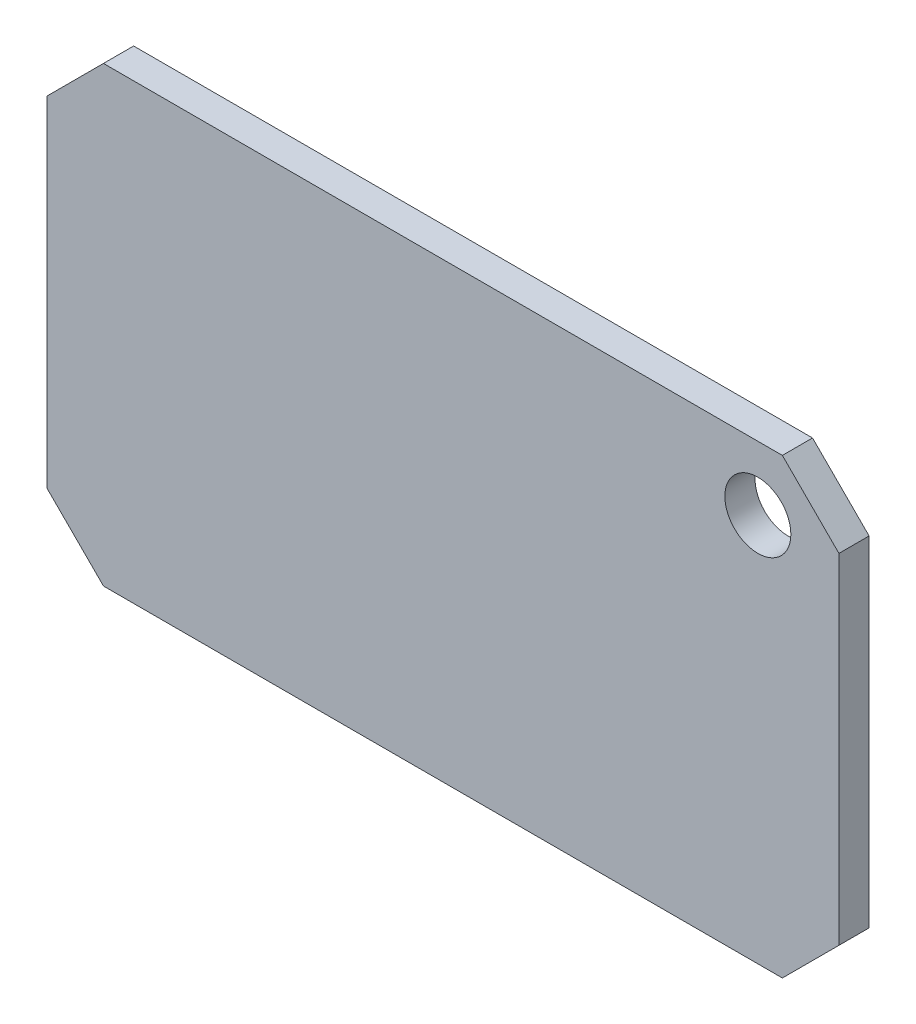
ISO-10303-21;
HEADER;
FILE_DESCRIPTION(('STEP AP214'),'2;1');
FILE_NAME('part.step','',(''),(''),'','','');
FILE_SCHEMA(('AUTOMOTIVE_DESIGN { 1 0 10303 214 1 1 1 1 }'));
ENDSEC;
DATA;
#1=APPLICATION_CONTEXT('core data for automotive mechanical design processes');
#2=APPLICATION_PROTOCOL_DEFINITION('international standard','automotive_design',2000,#1);
#3=PRODUCT_CONTEXT('',#1,'mechanical');
#4=PRODUCT('Part','Part','',(#3));
#5=PRODUCT_RELATED_PRODUCT_CATEGORY('part','',(#4));
#6=PRODUCT_DEFINITION_FORMATION('','',#4);
#7=PRODUCT_DEFINITION_CONTEXT('part definition',#1,'design');
#8=PRODUCT_DEFINITION('design','',#6,#7);
#9=PRODUCT_DEFINITION_SHAPE('','',#8);
#10=(LENGTH_UNIT() NAMED_UNIT(*) SI_UNIT(.MILLI.,.METRE.));
#11=(NAMED_UNIT(*) PLANE_ANGLE_UNIT() SI_UNIT($,.RADIAN.));
#12=(NAMED_UNIT(*) SI_UNIT($,.STERADIAN.) SOLID_ANGLE_UNIT());
#13=UNCERTAINTY_MEASURE_WITH_UNIT(LENGTH_MEASURE(1.E-05),#10,'distance_accuracy_value','');
#14=(GEOMETRIC_REPRESENTATION_CONTEXT(3) GLOBAL_UNCERTAINTY_ASSIGNED_CONTEXT((#13)) GLOBAL_UNIT_ASSIGNED_CONTEXT((#10,
#11,#12)) REPRESENTATION_CONTEXT('',''));
#15=CARTESIAN_POINT('',(0.,0.,0.));
#16=DIRECTION('',(0.,0.,1.));
#17=DIRECTION('',(1.,0.,0.));
#18=AXIS2_PLACEMENT_3D('',#15,#16,#17);
#19=CARTESIAN_POINT('',(0.,0.,1.6));
#20=DIRECTION('',(0.,0.,-1.));
#21=DIRECTION('',(-1.,0.,0.));
#22=AXIS2_PLACEMENT_3D('',#19,#20,#21);
#23=PLANE('',#22);
#24=DIRECTION('',(0.,-1.,0.));
#25=VECTOR('',#24,1.);
#26=CARTESIAN_POINT('',(-21.,-9.,1.6));
#27=LINE('',#26,#25);
#28=CARTESIAN_POINT('',(-21.,9.,1.6));
#29=VERTEX_POINT('',#28);
#30=CARTESIAN_POINT('',(-21.,-9.,1.6));
#31=VERTEX_POINT('',#30);
#32=EDGE_CURVE('E147',#29,#31,#27,.T.);
#33=ORIENTED_EDGE('',*,*,#32,.T.);
#34=DIRECTION('',(0.707106781186557,-0.707106781186538,0.));
#35=VECTOR('',#34,1.);
#36=CARTESIAN_POINT('',(-18.,-12.,1.6));
#37=LINE('',#36,#35);
#38=CARTESIAN_POINT('',(-18.,-12.,1.6));
#39=VERTEX_POINT('',#38);
#40=EDGE_CURVE('E95',#31,#39,#37,.T.);
#41=ORIENTED_EDGE('',*,*,#40,.T.);
#42=DIRECTION('',(1.,0.,0.));
#43=VECTOR('',#42,1.);
#44=CARTESIAN_POINT('',(18.,-12.,1.6));
#45=LINE('',#44,#43);
#46=CARTESIAN_POINT('',(18.,-12.,1.6));
#47=VERTEX_POINT('',#46);
#48=EDGE_CURVE('E162',#39,#47,#45,.T.);
#49=ORIENTED_EDGE('',*,*,#48,.T.);
#50=DIRECTION('',(0.707106781186552,0.707106781186543,0.));
#51=VECTOR('',#50,1.);
#52=CARTESIAN_POINT('',(21.,-9.00000000000001,1.6));
#53=LINE('',#52,#51);
#54=CARTESIAN_POINT('',(21.,-9.00000000000001,1.6));
#55=VERTEX_POINT('',#54);
#56=EDGE_CURVE('E175',#47,#55,#53,.T.);
#57=ORIENTED_EDGE('',*,*,#56,.T.);
#58=DIRECTION('',(0.,1.,0.));
#59=VECTOR('',#58,1.);
#60=CARTESIAN_POINT('',(21.,9.,1.6));
#61=LINE('',#60,#59);
#62=CARTESIAN_POINT('',(21.,9.,1.6));
#63=VERTEX_POINT('',#62);
#64=EDGE_CURVE('E114',#55,#63,#61,.T.);
#65=ORIENTED_EDGE('',*,*,#64,.T.);
#66=DIRECTION('',(-0.707106781186544,0.707106781186551,0.));
#67=VECTOR('',#66,1.);
#68=CARTESIAN_POINT('',(18.,12.,1.6));
#69=LINE('',#68,#67);
#70=CARTESIAN_POINT('',(18.,12.,1.6));
#71=VERTEX_POINT('',#70);
#72=EDGE_CURVE('E108',#63,#71,#69,.T.);
#73=ORIENTED_EDGE('',*,*,#72,.T.);
#74=DIRECTION('',(-1.,0.,0.));
#75=VECTOR('',#74,1.);
#76=CARTESIAN_POINT('',(-18.,12.,1.6));
#77=LINE('',#76,#75);
#78=CARTESIAN_POINT('',(-18.,12.,1.6));
#79=VERTEX_POINT('',#78);
#80=EDGE_CURVE('E112',#71,#79,#77,.T.);
#81=ORIENTED_EDGE('',*,*,#80,.T.);
#82=DIRECTION('',(-0.707106781186552,-0.707106781186543,0.));
#83=VECTOR('',#82,1.);
#84=CARTESIAN_POINT('',(-21.,9.,1.6));
#85=LINE('',#84,#83);
#86=EDGE_CURVE('E52',#79,#29,#85,.T.);
#87=ORIENTED_EDGE('',*,*,#86,.T.);
#88=EDGE_LOOP('',(#33,#41,#49,#57,#65,#73,#81,#87));
#89=FACE_BOUND('',#88,.T.);
#90=CARTESIAN_POINT('',(16.7,8.60000000000003,1.6));
#91=DIRECTION('',(0.,0.,1.));
#92=DIRECTION('',(1.,0.,0.));
#93=AXIS2_PLACEMENT_3D('',#90,#91,#92);
#94=CIRCLE('',#93,1.75);
#95=CARTESIAN_POINT('',(18.45,8.60000000000003,1.6));
#96=VERTEX_POINT('',#95);
#97=EDGE_CURVE('E136',#96,#96,#94,.T.);
#98=ORIENTED_EDGE('',*,*,#97,.F.);
#99=EDGE_LOOP('',(#98));
#100=FACE_BOUND('',#99,.T.);
#101=ADVANCED_FACE('F35',(#89,#100),#23,.F.);
#102=CARTESIAN_POINT('',(0.,0.,0.));
#103=DIRECTION('',(0.,0.,-1.));
#104=DIRECTION('',(-1.,0.,0.));
#105=AXIS2_PLACEMENT_3D('',#102,#103,#104);
#106=PLANE('',#105);
#107=DIRECTION('',(0.,-1.,0.));
#108=VECTOR('',#107,1.);
#109=CARTESIAN_POINT('',(-21.,-9.,0.));
#110=LINE('',#109,#108);
#111=CARTESIAN_POINT('',(-21.,9.,0.));
#112=VERTEX_POINT('',#111);
#113=CARTESIAN_POINT('',(-21.,-9.,0.));
#114=VERTEX_POINT('',#113);
#115=EDGE_CURVE('E132',#112,#114,#110,.T.);
#116=ORIENTED_EDGE('',*,*,#115,.F.);
#117=DIRECTION('',(-0.707106781186552,-0.707106781186543,0.));
#118=VECTOR('',#117,1.);
#119=CARTESIAN_POINT('',(-21.,9.,0.));
#120=LINE('',#119,#118);
#121=CARTESIAN_POINT('',(-18.,12.,0.));
#122=VERTEX_POINT('',#121);
#123=EDGE_CURVE('E87',#122,#112,#120,.T.);
#124=ORIENTED_EDGE('',*,*,#123,.F.);
#125=DIRECTION('',(-1.,0.,0.));
#126=VECTOR('',#125,1.);
#127=CARTESIAN_POINT('',(-18.,12.,0.));
#128=LINE('',#127,#126);
#129=CARTESIAN_POINT('',(18.,12.,0.));
#130=VERTEX_POINT('',#129);
#131=EDGE_CURVE('E81',#130,#122,#128,.T.);
#132=ORIENTED_EDGE('',*,*,#131,.F.);
#133=DIRECTION('',(-0.707106781186544,0.707106781186551,0.));
#134=VECTOR('',#133,1.);
#135=CARTESIAN_POINT('',(18.,12.,0.));
#136=LINE('',#135,#134);
#137=CARTESIAN_POINT('',(21.,9.,0.));
#138=VERTEX_POINT('',#137);
#139=EDGE_CURVE('E122',#138,#130,#136,.T.);
#140=ORIENTED_EDGE('',*,*,#139,.F.);
#141=DIRECTION('',(0.,1.,0.));
#142=VECTOR('',#141,1.);
#143=CARTESIAN_POINT('',(21.,9.,0.));
#144=LINE('',#143,#142);
#145=CARTESIAN_POINT('',(21.,-9.00000000000001,0.));
#146=VERTEX_POINT('',#145);
#147=EDGE_CURVE('E142',#146,#138,#144,.T.);
#148=ORIENTED_EDGE('',*,*,#147,.F.);
#149=DIRECTION('',(0.707106781186552,0.707106781186543,0.));
#150=VECTOR('',#149,1.);
#151=CARTESIAN_POINT('',(21.,-9.00000000000001,0.));
#152=LINE('',#151,#150);
#153=CARTESIAN_POINT('',(18.,-12.,0.));
#154=VERTEX_POINT('',#153);
#155=EDGE_CURVE('E140',#154,#146,#152,.T.);
#156=ORIENTED_EDGE('',*,*,#155,.F.);
#157=DIRECTION('',(1.,0.,0.));
#158=VECTOR('',#157,1.);
#159=CARTESIAN_POINT('',(18.,-12.,0.));
#160=LINE('',#159,#158);
#161=CARTESIAN_POINT('',(-18.,-12.,0.));
#162=VERTEX_POINT('',#161);
#163=EDGE_CURVE('E138',#162,#154,#160,.T.);
#164=ORIENTED_EDGE('',*,*,#163,.F.);
#165=DIRECTION('',(0.707106781186557,-0.707106781186538,0.));
#166=VECTOR('',#165,1.);
#167=CARTESIAN_POINT('',(-18.,-12.,0.));
#168=LINE('',#167,#166);
#169=EDGE_CURVE('E135',#114,#162,#168,.T.);
#170=ORIENTED_EDGE('',*,*,#169,.F.);
#171=EDGE_LOOP('',(#116,#124,#132,#140,#148,#156,#164,#170));
#172=FACE_BOUND('',#171,.T.);
#173=CARTESIAN_POINT('',(16.7,8.60000000000003,0.));
#174=DIRECTION('',(0.,0.,1.));
#175=DIRECTION('',(1.,0.,0.));
#176=AXIS2_PLACEMENT_3D('',#173,#174,#175);
#177=CIRCLE('',#176,1.75);
#178=CARTESIAN_POINT('',(18.45,8.60000000000003,0.));
#179=VERTEX_POINT('',#178);
#180=EDGE_CURVE('E181',#179,#179,#177,.T.);
#181=ORIENTED_EDGE('',*,*,#180,.T.);
#182=EDGE_LOOP('',(#181));
#183=FACE_BOUND('',#182,.T.);
#184=ADVANCED_FACE('F166',(#172,#183),#106,.T.);
#185=CARTESIAN_POINT('',(-21.,-9.,1.6));
#186=DIRECTION('',(1.,0.,0.));
#187=DIRECTION('',(0.,1.,0.));
#188=AXIS2_PLACEMENT_3D('',#185,#186,#187);
#189=PLANE('',#188);
#190=ORIENTED_EDGE('',*,*,#115,.T.);
#191=DIRECTION('',(0.,0.,-1.));
#192=VECTOR('',#191,1.);
#193=CARTESIAN_POINT('',(-21.,-9.,1.6));
#194=LINE('',#193,#192);
#195=EDGE_CURVE('E11',#31,#114,#194,.T.);
#196=ORIENTED_EDGE('',*,*,#195,.F.);
#197=ORIENTED_EDGE('',*,*,#32,.F.);
#198=DIRECTION('',(0.,0.,-1.));
#199=VECTOR('',#198,1.);
#200=CARTESIAN_POINT('',(-21.,9.,1.6));
#201=LINE('',#200,#199);
#202=EDGE_CURVE('E128',#29,#112,#201,.T.);
#203=ORIENTED_EDGE('',*,*,#202,.T.);
#204=EDGE_LOOP('',(#190,#196,#197,#203));
#205=FACE_BOUND('',#204,.T.);
#206=ADVANCED_FACE('F37',(#205),#189,.F.);
#207=CARTESIAN_POINT('',(-18.,-12.,1.6));
#208=DIRECTION('',(0.707106781186538,0.707106781186557,0.));
#209=DIRECTION('',(-0.707106781186557,0.707106781186538,0.));
#210=AXIS2_PLACEMENT_3D('',#207,#208,#209);
#211=PLANE('',#210);
#212=ORIENTED_EDGE('',*,*,#169,.T.);
#213=DIRECTION('',(0.,0.,-1.));
#214=VECTOR('',#213,1.);
#215=CARTESIAN_POINT('',(-18.,-12.,1.6));
#216=LINE('',#215,#214);
#217=EDGE_CURVE('E44',#39,#162,#216,.T.);
#218=ORIENTED_EDGE('',*,*,#217,.F.);
#219=ORIENTED_EDGE('',*,*,#40,.F.);
#220=ORIENTED_EDGE('',*,*,#195,.T.);
#221=EDGE_LOOP('',(#212,#218,#219,#220));
#222=FACE_BOUND('',#221,.T.);
#223=ADVANCED_FACE('F209',(#222),#211,.F.);
#224=CARTESIAN_POINT('',(18.,-12.,1.6));
#225=DIRECTION('',(0.,1.,0.));
#226=DIRECTION('',(0.,0.,1.));
#227=AXIS2_PLACEMENT_3D('',#224,#225,#226);
#228=PLANE('',#227);
#229=ORIENTED_EDGE('',*,*,#163,.T.);
#230=DIRECTION('',(0.,0.,-1.));
#231=VECTOR('',#230,1.);
#232=CARTESIAN_POINT('',(18.,-12.,1.6));
#233=LINE('',#232,#231);
#234=EDGE_CURVE('E154',#47,#154,#233,.T.);
#235=ORIENTED_EDGE('',*,*,#234,.F.);
#236=ORIENTED_EDGE('',*,*,#48,.F.);
#237=ORIENTED_EDGE('',*,*,#217,.T.);
#238=EDGE_LOOP('',(#229,#235,#236,#237));
#239=FACE_BOUND('',#238,.T.);
#240=ADVANCED_FACE('F160',(#239),#228,.F.);
#241=CARTESIAN_POINT('',(21.,-9.00000000000001,1.6));
#242=DIRECTION('',(-0.707106781186543,0.707106781186552,0.));
#243=DIRECTION('',(-0.707106781186552,-0.707106781186543,0.));
#244=AXIS2_PLACEMENT_3D('',#241,#242,#243);
#245=PLANE('',#244);
#246=ORIENTED_EDGE('',*,*,#155,.T.);
#247=DIRECTION('',(0.,0.,-1.));
#248=VECTOR('',#247,1.);
#249=CARTESIAN_POINT('',(21.,-9.00000000000001,1.6));
#250=LINE('',#249,#248);
#251=EDGE_CURVE('E151',#55,#146,#250,.T.);
#252=ORIENTED_EDGE('',*,*,#251,.F.);
#253=ORIENTED_EDGE('',*,*,#56,.F.);
#254=ORIENTED_EDGE('',*,*,#234,.T.);
#255=EDGE_LOOP('',(#246,#252,#253,#254));
#256=FACE_BOUND('',#255,.T.);
#257=ADVANCED_FACE('F171',(#256),#245,.F.);
#258=CARTESIAN_POINT('',(21.,9.,1.6));
#259=DIRECTION('',(-1.,0.,0.));
#260=DIRECTION('',(0.,-1.,0.));
#261=AXIS2_PLACEMENT_3D('',#258,#259,#260);
#262=PLANE('',#261);
#263=ORIENTED_EDGE('',*,*,#147,.T.);
#264=DIRECTION('',(0.,0.,-1.));
#265=VECTOR('',#264,1.);
#266=CARTESIAN_POINT('',(21.,9.,1.6));
#267=LINE('',#266,#265);
#268=EDGE_CURVE('E123',#63,#138,#267,.T.);
#269=ORIENTED_EDGE('',*,*,#268,.F.);
#270=ORIENTED_EDGE('',*,*,#64,.F.);
#271=ORIENTED_EDGE('',*,*,#251,.T.);
#272=EDGE_LOOP('',(#263,#269,#270,#271));
#273=FACE_BOUND('',#272,.T.);
#274=ADVANCED_FACE('F174',(#273),#262,.F.);
#275=CARTESIAN_POINT('',(18.,12.,1.6));
#276=DIRECTION('',(-0.707106781186551,-0.707106781186544,0.));
#277=DIRECTION('',(0.707106781186544,-0.707106781186551,0.));
#278=AXIS2_PLACEMENT_3D('',#275,#276,#277);
#279=PLANE('',#278);
#280=ORIENTED_EDGE('',*,*,#139,.T.);
#281=DIRECTION('',(0.,0.,-1.));
#282=VECTOR('',#281,1.);
#283=CARTESIAN_POINT('',(18.,12.,1.6));
#284=LINE('',#283,#282);
#285=EDGE_CURVE('E119',#71,#130,#284,.T.);
#286=ORIENTED_EDGE('',*,*,#285,.F.);
#287=ORIENTED_EDGE('',*,*,#72,.F.);
#288=ORIENTED_EDGE('',*,*,#268,.T.);
#289=EDGE_LOOP('',(#280,#286,#287,#288));
#290=FACE_BOUND('',#289,.T.);
#291=ADVANCED_FACE('F120',(#290),#279,.F.);
#292=CARTESIAN_POINT('',(-18.,12.,1.6));
#293=DIRECTION('',(0.,-1.,0.));
#294=DIRECTION('',(0.,0.,-1.));
#295=AXIS2_PLACEMENT_3D('',#292,#293,#294);
#296=PLANE('',#295);
#297=ORIENTED_EDGE('',*,*,#131,.T.);
#298=DIRECTION('',(0.,0.,-1.));
#299=VECTOR('',#298,1.);
#300=CARTESIAN_POINT('',(-18.,12.,1.6));
#301=LINE('',#300,#299);
#302=EDGE_CURVE('E124',#79,#122,#301,.T.);
#303=ORIENTED_EDGE('',*,*,#302,.F.);
#304=ORIENTED_EDGE('',*,*,#80,.F.);
#305=ORIENTED_EDGE('',*,*,#285,.T.);
#306=EDGE_LOOP('',(#297,#303,#304,#305));
#307=FACE_BOUND('',#306,.T.);
#308=ADVANCED_FACE('F126',(#307),#296,.F.);
#309=CARTESIAN_POINT('',(-21.,9.,1.6));
#310=DIRECTION('',(0.707106781186543,-0.707106781186552,0.));
#311=DIRECTION('',(0.707106781186552,0.707106781186543,0.));
#312=AXIS2_PLACEMENT_3D('',#309,#310,#311);
#313=PLANE('',#312);
#314=ORIENTED_EDGE('',*,*,#123,.T.);
#315=ORIENTED_EDGE('',*,*,#202,.F.);
#316=ORIENTED_EDGE('',*,*,#86,.F.);
#317=ORIENTED_EDGE('',*,*,#302,.T.);
#318=EDGE_LOOP('',(#314,#315,#316,#317));
#319=FACE_BOUND('',#318,.T.);
#320=ADVANCED_FACE('F197',(#319),#313,.F.);
#321=CARTESIAN_POINT('',(16.7,8.60000000000003,1.6));
#322=DIRECTION('',(0.,0.,-1.));
#323=DIRECTION('',(-1.,0.,0.));
#324=AXIS2_PLACEMENT_3D('',#321,#322,#323);
#325=CYLINDRICAL_SURFACE('',#324,1.75);
#326=ORIENTED_EDGE('',*,*,#97,.T.);
#327=EDGE_LOOP('',(#326));
#328=FACE_BOUND('',#327,.T.);
#329=ORIENTED_EDGE('',*,*,#180,.F.);
#330=EDGE_LOOP('',(#329));
#331=FACE_BOUND('',#330,.T.);
#332=ADVANCED_FACE('F187',(#328,#331),#325,.F.);
#333=CLOSED_SHELL('',(#101,#184,#206,#223,#240,#257,#274,#291,#308,#320,#332));
#334=MANIFOLD_SOLID_BREP('B2',#333);
#335=ADVANCED_BREP_SHAPE_REPRESENTATION('',(#18,#334),#14);
#336=SHAPE_DEFINITION_REPRESENTATION(#9,#335);
ENDSEC;
END-ISO-10303-21;
